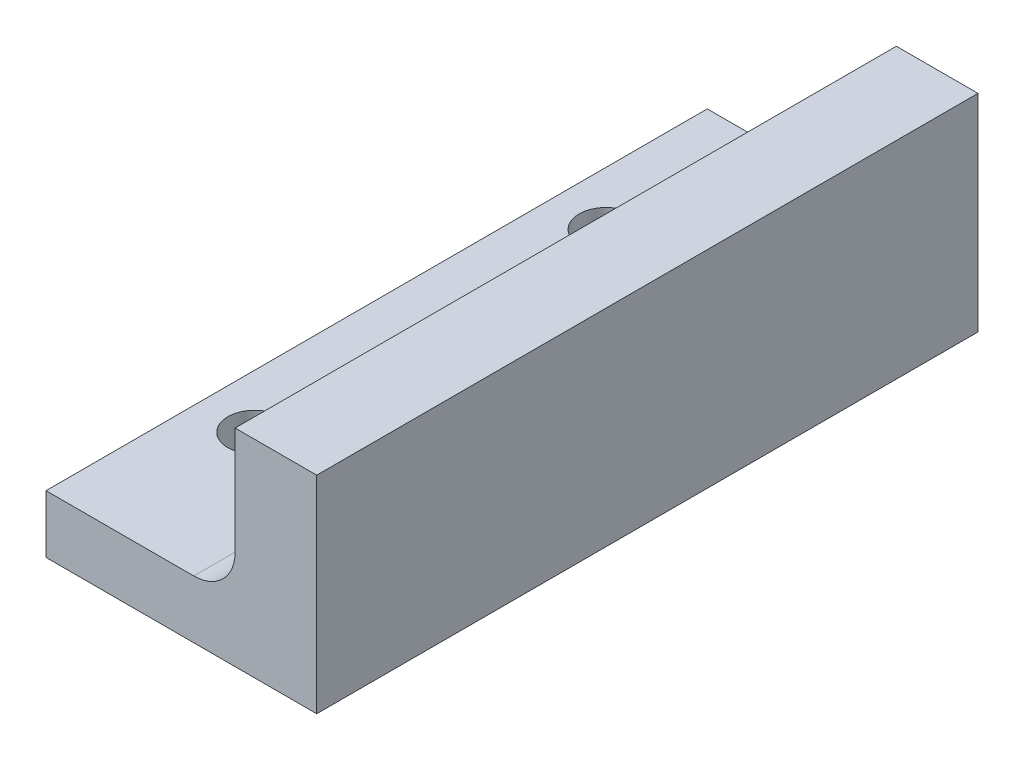
ISO-10303-21;
HEADER;
FILE_DESCRIPTION(('STEP AP214'),'2;1');
FILE_NAME('part.step','',(''),(''),'','','');
FILE_SCHEMA(('AUTOMOTIVE_DESIGN { 1 0 10303 214 1 1 1 1 }'));
ENDSEC;
DATA;
#1=APPLICATION_CONTEXT('core data for automotive mechanical design processes');
#2=APPLICATION_PROTOCOL_DEFINITION('international standard','automotive_design',2000,#1);
#3=PRODUCT_CONTEXT('',#1,'mechanical');
#4=PRODUCT('Part','Part','',(#3));
#5=PRODUCT_RELATED_PRODUCT_CATEGORY('part','',(#4));
#6=PRODUCT_DEFINITION_FORMATION('','',#4);
#7=PRODUCT_DEFINITION_CONTEXT('part definition',#1,'design');
#8=PRODUCT_DEFINITION('design','',#6,#7);
#9=PRODUCT_DEFINITION_SHAPE('','',#8);
#10=(LENGTH_UNIT() NAMED_UNIT(*) SI_UNIT(.MILLI.,.METRE.));
#11=(NAMED_UNIT(*) PLANE_ANGLE_UNIT() SI_UNIT($,.RADIAN.));
#12=(NAMED_UNIT(*) SI_UNIT($,.STERADIAN.) SOLID_ANGLE_UNIT());
#13=UNCERTAINTY_MEASURE_WITH_UNIT(LENGTH_MEASURE(1.E-05),#10,'distance_accuracy_value','');
#14=(GEOMETRIC_REPRESENTATION_CONTEXT(3) GLOBAL_UNCERTAINTY_ASSIGNED_CONTEXT((#13)) GLOBAL_UNIT_ASSIGNED_CONTEXT((#10,
#11,#12)) REPRESENTATION_CONTEXT('',''));
#15=CARTESIAN_POINT('',(0.,0.,0.));
#16=DIRECTION('',(0.,0.,1.));
#17=DIRECTION('',(1.,0.,0.));
#18=AXIS2_PLACEMENT_3D('',#15,#16,#17);
#19=CARTESIAN_POINT('',(0.,2.8,0.));
#20=DIRECTION('',(0.,-1.,0.));
#21=DIRECTION('',(0.,0.,-1.));
#22=AXIS2_PLACEMENT_3D('',#19,#20,#21);
#23=PLANE('',#22);
#24=DIRECTION('',(1.,0.,0.));
#25=VECTOR('',#24,1.);
#26=CARTESIAN_POINT('',(2.6,2.8,16.));
#27=LINE('',#26,#25);
#28=CARTESIAN_POINT('',(-2.6,2.8,16.));
#29=VERTEX_POINT('',#28);
#30=CARTESIAN_POINT('',(4.55,2.8,16.));
#31=VERTEX_POINT('',#30);
#32=EDGE_CURVE('E138',#29,#31,#27,.T.);
#33=ORIENTED_EDGE('',*,*,#32,.T.);
#34=DIRECTION('',(0.,0.,-1.));
#35=VECTOR('',#34,1.);
#36=CARTESIAN_POINT('',(4.55,2.8,-16.));
#37=LINE('',#36,#35);
#38=CARTESIAN_POINT('',(4.55,2.8,-16.));
#39=VERTEX_POINT('',#38);
#40=EDGE_CURVE('E155',#31,#39,#37,.T.);
#41=ORIENTED_EDGE('',*,*,#40,.T.);
#42=DIRECTION('',(-1.,0.,0.));
#43=VECTOR('',#42,1.);
#44=CARTESIAN_POINT('',(2.6,2.8,-16.));
#45=LINE('',#44,#43);
#46=CARTESIAN_POINT('',(-2.6,2.8,-16.));
#47=VERTEX_POINT('',#46);
#48=EDGE_CURVE('E142',#39,#47,#45,.T.);
#49=ORIENTED_EDGE('',*,*,#48,.T.);
#50=DIRECTION('',(0.,0.,1.));
#51=VECTOR('',#50,1.);
#52=CARTESIAN_POINT('',(-2.6,2.8,-16.));
#53=LINE('',#52,#51);
#54=EDGE_CURVE('E135',#47,#29,#53,.T.);
#55=ORIENTED_EDGE('',*,*,#54,.T.);
#56=EDGE_LOOP('',(#33,#41,#49,#55));
#57=FACE_BOUND('',#56,.T.);
#58=CARTESIAN_POINT('',(0.,2.8,8.5));
#59=DIRECTION('',(0.,1.,0.));
#60=DIRECTION('',(0.,0.,1.));
#61=AXIS2_PLACEMENT_3D('',#58,#59,#60);
#62=CIRCLE('',#61,1.3);
#63=CARTESIAN_POINT('',(0.,2.8,9.8));
#64=VERTEX_POINT('',#63);
#65=EDGE_CURVE('E129',#64,#64,#62,.T.);
#66=ORIENTED_EDGE('',*,*,#65,.F.);
#67=EDGE_LOOP('',(#66));
#68=FACE_BOUND('',#67,.T.);
#69=CARTESIAN_POINT('',(0.,2.8,-8.5));
#70=DIRECTION('',(0.,1.,0.));
#71=DIRECTION('',(0.,0.,1.));
#72=AXIS2_PLACEMENT_3D('',#69,#70,#71);
#73=CIRCLE('',#72,1.3);
#74=CARTESIAN_POINT('',(0.,2.8,-7.2));
#75=VERTEX_POINT('',#74);
#76=EDGE_CURVE('E121',#75,#75,#73,.T.);
#77=ORIENTED_EDGE('',*,*,#76,.F.);
#78=EDGE_LOOP('',(#77));
#79=FACE_BOUND('',#78,.T.);
#80=ADVANCED_FACE('F43',(#57,#68,#79),#23,.F.);
#81=CARTESIAN_POINT('',(0.,0.,0.));
#82=DIRECTION('',(0.,-1.,0.));
#83=DIRECTION('',(0.,0.,-1.));
#84=AXIS2_PLACEMENT_3D('',#81,#82,#83);
#85=PLANE('',#84);
#86=CARTESIAN_POINT('',(0.,0.,8.5));
#87=DIRECTION('',(0.,1.,0.));
#88=DIRECTION('',(0.,0.,1.));
#89=AXIS2_PLACEMENT_3D('',#86,#87,#88);
#90=CIRCLE('',#89,1.3);
#91=CARTESIAN_POINT('',(0.,0.,9.8));
#92=VERTEX_POINT('',#91);
#93=EDGE_CURVE('E127',#92,#92,#90,.T.);
#94=ORIENTED_EDGE('',*,*,#93,.T.);
#95=EDGE_LOOP('',(#94));
#96=FACE_BOUND('',#95,.T.);
#97=DIRECTION('',(0.,0.,1.));
#98=VECTOR('',#97,1.);
#99=CARTESIAN_POINT('',(-2.6,0.,-16.));
#100=LINE('',#99,#98);
#101=CARTESIAN_POINT('',(-2.6,0.,-16.));
#102=VERTEX_POINT('',#101);
#103=CARTESIAN_POINT('',(-2.6,0.,16.));
#104=VERTEX_POINT('',#103);
#105=EDGE_CURVE('E132',#102,#104,#100,.T.);
#106=ORIENTED_EDGE('',*,*,#105,.F.);
#107=DIRECTION('',(-1.,0.,0.));
#108=VECTOR('',#107,1.);
#109=CARTESIAN_POINT('',(2.6,0.,-16.));
#110=LINE('',#109,#108);
#111=CARTESIAN_POINT('',(10.5,0.,-16.));
#112=VERTEX_POINT('',#111);
#113=EDGE_CURVE('E139',#112,#102,#110,.T.);
#114=ORIENTED_EDGE('',*,*,#113,.F.);
#115=DIRECTION('',(0.,0.,-1.));
#116=VECTOR('',#115,1.);
#117=CARTESIAN_POINT('',(10.5,0.,16.));
#118=LINE('',#117,#116);
#119=CARTESIAN_POINT('',(10.5,0.,16.));
#120=VERTEX_POINT('',#119);
#121=EDGE_CURVE('E263',#120,#112,#118,.T.);
#122=ORIENTED_EDGE('',*,*,#121,.F.);
#123=DIRECTION('',(1.,0.,0.));
#124=VECTOR('',#123,1.);
#125=CARTESIAN_POINT('',(2.6,0.,16.));
#126=LINE('',#125,#124);
#127=EDGE_CURVE('E147',#104,#120,#126,.T.);
#128=ORIENTED_EDGE('',*,*,#127,.F.);
#129=EDGE_LOOP('',(#106,#114,#122,#128));
#130=FACE_BOUND('',#129,.T.);
#131=CARTESIAN_POINT('',(0.,0.,-8.5));
#132=DIRECTION('',(0.,1.,0.));
#133=DIRECTION('',(0.,0.,1.));
#134=AXIS2_PLACEMENT_3D('',#131,#132,#133);
#135=CIRCLE('',#134,1.3);
#136=CARTESIAN_POINT('',(0.,0.,-7.2));
#137=VERTEX_POINT('',#136);
#138=EDGE_CURVE('E117',#137,#137,#135,.T.);
#139=ORIENTED_EDGE('',*,*,#138,.T.);
#140=EDGE_LOOP('',(#139));
#141=FACE_BOUND('',#140,.T.);
#142=ADVANCED_FACE('F180',(#96,#130,#141),#85,.T.);
#143=CARTESIAN_POINT('',(-2.6,2.8,-16.));
#144=DIRECTION('',(1.,0.,0.));
#145=DIRECTION('',(0.,0.,-1.));
#146=AXIS2_PLACEMENT_3D('',#143,#144,#145);
#147=PLANE('',#146);
#148=ORIENTED_EDGE('',*,*,#105,.T.);
#149=DIRECTION('',(0.,-1.,0.));
#150=VECTOR('',#149,1.);
#151=CARTESIAN_POINT('',(-2.6,2.8,16.));
#152=LINE('',#151,#150);
#153=EDGE_CURVE('E152',#29,#104,#152,.T.);
#154=ORIENTED_EDGE('',*,*,#153,.F.);
#155=ORIENTED_EDGE('',*,*,#54,.F.);
#156=DIRECTION('',(0.,-1.,0.));
#157=VECTOR('',#156,1.);
#158=CARTESIAN_POINT('',(-2.6,2.8,-16.));
#159=LINE('',#158,#157);
#160=EDGE_CURVE('E144',#47,#102,#159,.T.);
#161=ORIENTED_EDGE('',*,*,#160,.T.);
#162=EDGE_LOOP('',(#148,#154,#155,#161));
#163=FACE_BOUND('',#162,.T.);
#164=ADVANCED_FACE('F168',(#163),#147,.F.);
#165=CARTESIAN_POINT('',(2.6,2.8,16.));
#166=DIRECTION('',(0.,0.,-1.));
#167=DIRECTION('',(-1.,0.,0.));
#168=AXIS2_PLACEMENT_3D('',#165,#166,#167);
#169=PLANE('',#168);
#170=DIRECTION('',(0.,1.,0.));
#171=VECTOR('',#170,1.);
#172=CARTESIAN_POINT('',(6.55,-29.4428674283166,16.));
#173=LINE('',#172,#171);
#174=CARTESIAN_POINT('',(6.55,4.79999999999998,16.));
#175=VERTEX_POINT('',#174);
#176=CARTESIAN_POINT('',(6.55,10.,16.));
#177=VERTEX_POINT('',#176);
#178=EDGE_CURVE('E106',#175,#177,#173,.T.);
#179=ORIENTED_EDGE('',*,*,#178,.F.);
#180=CARTESIAN_POINT('',(4.55,4.8,16.));
#181=DIRECTION('',(0.,0.,-1.));
#182=DIRECTION('',(-1.,0.,0.));
#183=AXIS2_PLACEMENT_3D('',#180,#181,#182);
#184=CIRCLE('',#183,2.);
#185=EDGE_CURVE('E11',#175,#31,#184,.T.);
#186=ORIENTED_EDGE('',*,*,#185,.T.);
#187=ORIENTED_EDGE('',*,*,#32,.F.);
#188=ORIENTED_EDGE('',*,*,#153,.T.);
#189=ORIENTED_EDGE('',*,*,#127,.T.);
#190=DIRECTION('',(0.,-1.,0.));
#191=VECTOR('',#190,1.);
#192=CARTESIAN_POINT('',(10.5,0.,16.));
#193=LINE('',#192,#191);
#194=CARTESIAN_POINT('',(10.5,10.,16.));
#195=VERTEX_POINT('',#194);
#196=EDGE_CURVE('E105',#195,#120,#193,.T.);
#197=ORIENTED_EDGE('',*,*,#196,.F.);
#198=DIRECTION('',(-1.,0.,0.));
#199=VECTOR('',#198,1.);
#200=CARTESIAN_POINT('',(10.5,10.,16.));
#201=LINE('',#200,#199);
#202=EDGE_CURVE('E118',#195,#177,#201,.T.);
#203=ORIENTED_EDGE('',*,*,#202,.T.);
#204=EDGE_LOOP('',(#179,#186,#187,#188,#189,#197,#203));
#205=FACE_BOUND('',#204,.T.);
#206=ADVANCED_FACE('F170',(#205),#169,.F.);
#207=CARTESIAN_POINT('',(2.6,2.8,-16.));
#208=DIRECTION('',(0.,0.,1.));
#209=DIRECTION('',(1.,0.,0.));
#210=AXIS2_PLACEMENT_3D('',#207,#208,#209);
#211=PLANE('',#210);
#212=ORIENTED_EDGE('',*,*,#48,.F.);
#213=CARTESIAN_POINT('',(4.55,4.8,-16.));
#214=DIRECTION('',(0.,0.,1.));
#215=DIRECTION('',(1.,0.,0.));
#216=AXIS2_PLACEMENT_3D('',#213,#214,#215);
#217=CIRCLE('',#216,2.);
#218=CARTESIAN_POINT('',(6.55,4.79999999999998,-16.));
#219=VERTEX_POINT('',#218);
#220=EDGE_CURVE('E51',#39,#219,#217,.T.);
#221=ORIENTED_EDGE('',*,*,#220,.T.);
#222=DIRECTION('',(0.,1.,0.));
#223=VECTOR('',#222,1.);
#224=CARTESIAN_POINT('',(6.55,-29.4428674283166,-16.));
#225=LINE('',#224,#223);
#226=CARTESIAN_POINT('',(6.55,10.,-16.));
#227=VERTEX_POINT('',#226);
#228=EDGE_CURVE('E98',#219,#227,#225,.T.);
#229=ORIENTED_EDGE('',*,*,#228,.T.);
#230=DIRECTION('',(-1.,0.,0.));
#231=VECTOR('',#230,1.);
#232=CARTESIAN_POINT('',(10.5,10.,-16.));
#233=LINE('',#232,#231);
#234=CARTESIAN_POINT('',(10.5,10.,-16.));
#235=VERTEX_POINT('',#234);
#236=EDGE_CURVE('E103',#235,#227,#233,.T.);
#237=ORIENTED_EDGE('',*,*,#236,.F.);
#238=DIRECTION('',(0.,1.,0.));
#239=VECTOR('',#238,1.);
#240=CARTESIAN_POINT('',(10.5,0.,-16.));
#241=LINE('',#240,#239);
#242=EDGE_CURVE('E265',#112,#235,#241,.T.);
#243=ORIENTED_EDGE('',*,*,#242,.F.);
#244=ORIENTED_EDGE('',*,*,#113,.T.);
#245=ORIENTED_EDGE('',*,*,#160,.F.);
#246=EDGE_LOOP('',(#212,#221,#229,#237,#243,#244,#245));
#247=FACE_BOUND('',#246,.T.);
#248=ADVANCED_FACE('F100',(#247),#211,.F.);
#249=CARTESIAN_POINT('',(0.,2.8,8.5));
#250=DIRECTION('',(0.,-1.,0.));
#251=DIRECTION('',(0.,0.,-1.));
#252=AXIS2_PLACEMENT_3D('',#249,#250,#251);
#253=CYLINDRICAL_SURFACE('',#252,1.3);
#254=ORIENTED_EDGE('',*,*,#65,.T.);
#255=EDGE_LOOP('',(#254));
#256=FACE_BOUND('',#255,.T.);
#257=ORIENTED_EDGE('',*,*,#93,.F.);
#258=EDGE_LOOP('',(#257));
#259=FACE_BOUND('',#258,.T.);
#260=ADVANCED_FACE('F188',(#256,#259),#253,.F.);
#261=CARTESIAN_POINT('',(0.,2.8,-8.5));
#262=DIRECTION('',(0.,-1.,0.));
#263=DIRECTION('',(0.,0.,-1.));
#264=AXIS2_PLACEMENT_3D('',#261,#262,#263);
#265=CYLINDRICAL_SURFACE('',#264,1.3);
#266=ORIENTED_EDGE('',*,*,#76,.T.);
#267=EDGE_LOOP('',(#266));
#268=FACE_BOUND('',#267,.T.);
#269=ORIENTED_EDGE('',*,*,#138,.F.);
#270=EDGE_LOOP('',(#269));
#271=FACE_BOUND('',#270,.T.);
#272=ADVANCED_FACE('F205',(#268,#271),#265,.F.);
#273=CARTESIAN_POINT('',(10.5,10.,16.));
#274=DIRECTION('',(0.,-1.,0.));
#275=DIRECTION('',(0.,0.,-1.));
#276=AXIS2_PLACEMENT_3D('',#273,#274,#275);
#277=PLANE('',#276);
#278=ORIENTED_EDGE('',*,*,#236,.T.);
#279=DIRECTION('',(0.,0.,-1.));
#280=VECTOR('',#279,1.);
#281=CARTESIAN_POINT('',(6.55,10.,-16.));
#282=LINE('',#281,#280);
#283=EDGE_CURVE('E109',#177,#227,#282,.T.);
#284=ORIENTED_EDGE('',*,*,#283,.F.);
#285=ORIENTED_EDGE('',*,*,#202,.F.);
#286=DIRECTION('',(0.,0.,1.));
#287=VECTOR('',#286,1.);
#288=CARTESIAN_POINT('',(10.5,10.,16.));
#289=LINE('',#288,#287);
#290=EDGE_CURVE('E116',#235,#195,#289,.T.);
#291=ORIENTED_EDGE('',*,*,#290,.F.);
#292=EDGE_LOOP('',(#278,#284,#285,#291));
#293=FACE_BOUND('',#292,.T.);
#294=ADVANCED_FACE('F115',(#293),#277,.F.);
#295=CARTESIAN_POINT('',(10.5,0.,0.));
#296=DIRECTION('',(-1.,0.,0.));
#297=DIRECTION('',(0.,0.,1.));
#298=AXIS2_PLACEMENT_3D('',#295,#296,#297);
#299=PLANE('',#298);
#300=ORIENTED_EDGE('',*,*,#196,.T.);
#301=ORIENTED_EDGE('',*,*,#121,.T.);
#302=ORIENTED_EDGE('',*,*,#242,.T.);
#303=ORIENTED_EDGE('',*,*,#290,.T.);
#304=EDGE_LOOP('',(#300,#301,#302,#303));
#305=FACE_BOUND('',#304,.T.);
#306=ADVANCED_FACE('F177',(#305),#299,.F.);
#307=CARTESIAN_POINT('',(6.55,-29.4428674283166,-16.));
#308=DIRECTION('',(1.,0.,0.));
#309=DIRECTION('',(0.,0.,-1.));
#310=AXIS2_PLACEMENT_3D('',#307,#308,#309);
#311=PLANE('',#310);
#312=ORIENTED_EDGE('',*,*,#228,.F.);
#313=DIRECTION('',(0.,0.,-1.));
#314=VECTOR('',#313,1.);
#315=CARTESIAN_POINT('',(6.55,4.8,16.));
#316=LINE('',#315,#314);
#317=EDGE_CURVE('E64',#219,#175,#316,.F.);
#318=ORIENTED_EDGE('',*,*,#317,.T.);
#319=ORIENTED_EDGE('',*,*,#178,.T.);
#320=ORIENTED_EDGE('',*,*,#283,.T.);
#321=EDGE_LOOP('',(#312,#318,#319,#320));
#322=FACE_BOUND('',#321,.T.);
#323=ADVANCED_FACE('F110',(#322),#311,.F.);
#324=CARTESIAN_POINT('',(4.55,4.8,0.));
#325=DIRECTION('',(0.,0.,1.));
#326=DIRECTION('',(1.,0.,0.));
#327=AXIS2_PLACEMENT_3D('',#324,#325,#326);
#328=CYLINDRICAL_SURFACE('',#327,2.);
#329=ORIENTED_EDGE('',*,*,#185,.F.);
#330=ORIENTED_EDGE('',*,*,#317,.F.);
#331=ORIENTED_EDGE('',*,*,#220,.F.);
#332=ORIENTED_EDGE('',*,*,#40,.F.);
#333=EDGE_LOOP('',(#329,#330,#331,#332));
#334=FACE_BOUND('',#333,.T.);
#335=ADVANCED_FACE('F45',(#334),#328,.F.);
#336=CLOSED_SHELL('',(#80,#142,#164,#206,#248,#260,#272,#294,#306,#323,#335));
#337=MANIFOLD_SOLID_BREP('B2',#336);
#338=ADVANCED_BREP_SHAPE_REPRESENTATION('',(#18,#337),#14);
#339=SHAPE_DEFINITION_REPRESENTATION(#9,#338);
ENDSEC;
END-ISO-10303-21;
